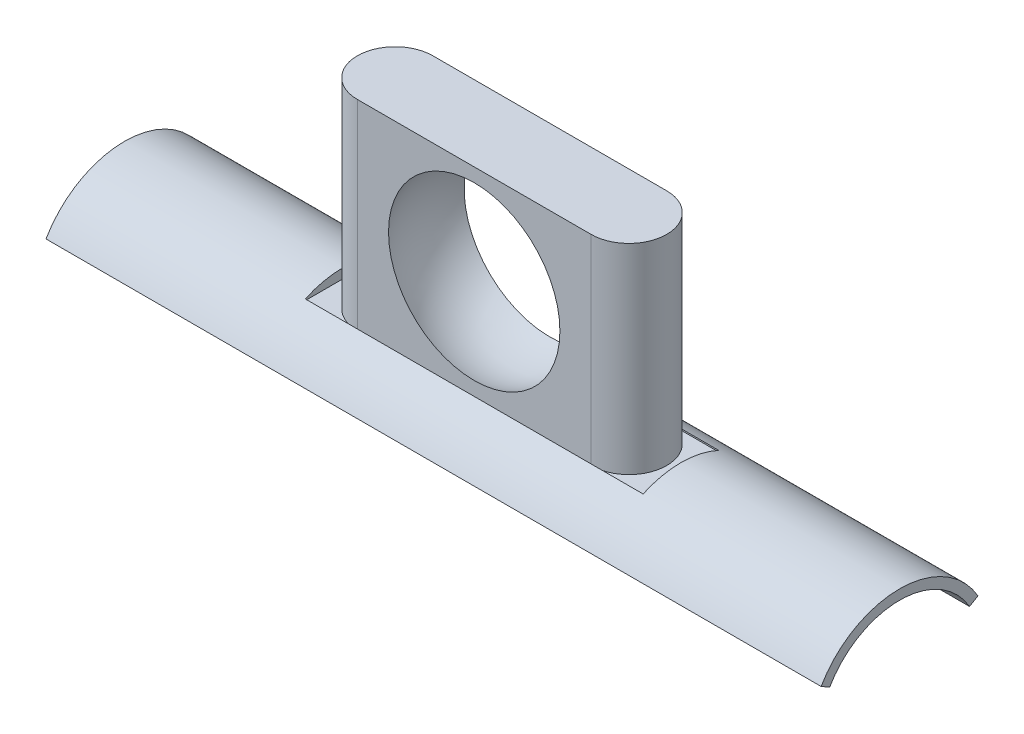
ISO-10303-21;
HEADER;
FILE_DESCRIPTION(('STEP AP214'),'2;1');
FILE_NAME('part.step','',(''),(''),'','','');
FILE_SCHEMA(('AUTOMOTIVE_DESIGN { 1 0 10303 214 1 1 1 1 }'));
ENDSEC;
DATA;
#1=APPLICATION_CONTEXT('core data for automotive mechanical design processes');
#2=APPLICATION_PROTOCOL_DEFINITION('international standard','automotive_design',2000,#1);
#3=PRODUCT_CONTEXT('',#1,'mechanical');
#4=PRODUCT('Part','Part','',(#3));
#5=PRODUCT_RELATED_PRODUCT_CATEGORY('part','',(#4));
#6=PRODUCT_DEFINITION_FORMATION('','',#4);
#7=PRODUCT_DEFINITION_CONTEXT('part definition',#1,'design');
#8=PRODUCT_DEFINITION('design','',#6,#7);
#9=PRODUCT_DEFINITION_SHAPE('','',#8);
#10=(LENGTH_UNIT() NAMED_UNIT(*) SI_UNIT(.MILLI.,.METRE.));
#11=(NAMED_UNIT(*) PLANE_ANGLE_UNIT() SI_UNIT($,.RADIAN.));
#12=(NAMED_UNIT(*) SI_UNIT($,.STERADIAN.) SOLID_ANGLE_UNIT());
#13=UNCERTAINTY_MEASURE_WITH_UNIT(LENGTH_MEASURE(1.E-05),#10,'distance_accuracy_value','');
#14=(GEOMETRIC_REPRESENTATION_CONTEXT(3) GLOBAL_UNCERTAINTY_ASSIGNED_CONTEXT((#13)) GLOBAL_UNIT_ASSIGNED_CONTEXT((#10,
#11,#12)) REPRESENTATION_CONTEXT('',''));
#15=CARTESIAN_POINT('',(0.,0.,0.));
#16=DIRECTION('',(0.,0.,1.));
#17=DIRECTION('',(1.,0.,0.));
#18=AXIS2_PLACEMENT_3D('',#15,#16,#17);
#19=CARTESIAN_POINT('',(-66.421,31.8135,-14.859));
#20=DIRECTION('',(0.,0.,-1.));
#21=DIRECTION('',(-1.,0.,0.));
#22=AXIS2_PLACEMENT_3D('',#19,#20,#21);
#23=PLANE('',#22);
#24=DIRECTION('',(0.,-1.,0.));
#25=VECTOR('',#24,1.);
#26=CARTESIAN_POINT('',(45.974,110.5535,-14.859));
#27=LINE('',#26,#25);
#28=CARTESIAN_POINT('',(45.974,32.3765944974143,-14.859));
#29=VERTEX_POINT('',#28);
#30=CARTESIAN_POINT('',(45.974,31.8135,-14.859));
#31=VERTEX_POINT('',#30);
#32=EDGE_CURVE('E256',#29,#31,#27,.T.);
#33=ORIENTED_EDGE('',*,*,#32,.T.);
#34=DIRECTION('',(-1.,0.,0.));
#35=VECTOR('',#34,1.);
#36=CARTESIAN_POINT('',(-66.421,31.8135,-14.859));
#37=LINE('',#36,#35);
#38=CARTESIAN_POINT('',(66.421,31.8135,-14.859));
#39=VERTEX_POINT('',#38);
#40=EDGE_CURVE('E182',#39,#31,#37,.T.);
#41=ORIENTED_EDGE('',*,*,#40,.F.);
#42=DIRECTION('',(0.,1.,0.));
#43=VECTOR('',#42,1.);
#44=CARTESIAN_POINT('',(66.421,31.8135,-14.859));
#45=LINE('',#44,#43);
#46=CARTESIAN_POINT('',(66.421,32.3765944974143,-14.859));
#47=VERTEX_POINT('',#46);
#48=EDGE_CURVE('E189',#39,#47,#45,.T.);
#49=ORIENTED_EDGE('',*,*,#48,.T.);
#50=DIRECTION('',(-1.,0.,0.));
#51=VECTOR('',#50,1.);
#52=CARTESIAN_POINT('',(152.4,32.3765944974143,-14.859));
#53=LINE('',#52,#51);
#54=EDGE_CURVE('E43',#29,#47,#53,.F.);
#55=ORIENTED_EDGE('',*,*,#54,.F.);
#56=EDGE_LOOP('',(#33,#41,#49,#55));
#57=FACE_BOUND('',#56,.T.);
#58=ADVANCED_FACE('F34',(#57),#23,.F.);
#59=CARTESIAN_POINT('',(-66.421,31.8135,14.859));
#60=DIRECTION('',(0.,0.,1.));
#61=DIRECTION('',(1.,0.,0.));
#62=AXIS2_PLACEMENT_3D('',#59,#60,#61);
#63=PLANE('',#62);
#64=DIRECTION('',(0.,-1.,0.));
#65=VECTOR('',#64,1.);
#66=CARTESIAN_POINT('',(-45.974,110.5535,14.859));
#67=LINE('',#66,#65);
#68=CARTESIAN_POINT('',(-45.974,32.3765944974143,14.859));
#69=VERTEX_POINT('',#68);
#70=CARTESIAN_POINT('',(-45.974,31.8135,14.859));
#71=VERTEX_POINT('',#70);
#72=EDGE_CURVE('E161',#69,#71,#67,.T.);
#73=ORIENTED_EDGE('',*,*,#72,.T.);
#74=DIRECTION('',(1.,0.,0.));
#75=VECTOR('',#74,1.);
#76=CARTESIAN_POINT('',(-66.421,31.8135,14.859));
#77=LINE('',#76,#75);
#78=CARTESIAN_POINT('',(-66.421,31.8135,14.859));
#79=VERTEX_POINT('',#78);
#80=EDGE_CURVE('E175',#79,#71,#77,.T.);
#81=ORIENTED_EDGE('',*,*,#80,.F.);
#82=DIRECTION('',(0.,1.,0.));
#83=VECTOR('',#82,1.);
#84=CARTESIAN_POINT('',(-66.421,31.8135,14.859));
#85=LINE('',#84,#83);
#86=CARTESIAN_POINT('',(-66.421,32.3765944974143,14.859));
#87=VERTEX_POINT('',#86);
#88=EDGE_CURVE('E184',#79,#87,#85,.T.);
#89=ORIENTED_EDGE('',*,*,#88,.T.);
#90=DIRECTION('',(-1.,0.,0.));
#91=VECTOR('',#90,1.);
#92=CARTESIAN_POINT('',(152.4,32.3765944974143,14.859));
#93=LINE('',#92,#91);
#94=EDGE_CURVE('E231',#69,#87,#93,.T.);
#95=ORIENTED_EDGE('',*,*,#94,.F.);
#96=EDGE_LOOP('',(#73,#81,#89,#95));
#97=FACE_BOUND('',#96,.T.);
#98=ADVANCED_FACE('F244',(#97),#63,.F.);
#99=CARTESIAN_POINT('',(0.,31.8135,0.));
#100=DIRECTION('',(0.,-1.,0.));
#101=DIRECTION('',(0.,0.,-1.));
#102=AXIS2_PLACEMENT_3D('',#99,#100,#101);
#103=PLANE('',#102);
#104=CARTESIAN_POINT('',(-45.974,31.8135,0.));
#105=DIRECTION('',(0.,1.,0.));
#106=DIRECTION('',(0.,0.,1.));
#107=AXIS2_PLACEMENT_3D('',#104,#105,#106);
#108=CIRCLE('',#107,14.859);
#109=CARTESIAN_POINT('',(-45.974,31.8135,-14.859));
#110=VERTEX_POINT('',#109);
#111=EDGE_CURVE('E247',#110,#71,#108,.T.);
#112=ORIENTED_EDGE('',*,*,#111,.F.);
#113=CARTESIAN_POINT('',(-66.421,31.8135,-14.859));
#114=VERTEX_POINT('',#113);
#115=EDGE_CURVE('E181',#110,#114,#37,.T.);
#116=ORIENTED_EDGE('',*,*,#115,.T.);
#117=DIRECTION('',(0.,0.,1.));
#118=VECTOR('',#117,1.);
#119=CARTESIAN_POINT('',(-66.421,31.8135,14.859));
#120=LINE('',#119,#118);
#121=EDGE_CURVE('E171',#114,#79,#120,.T.);
#122=ORIENTED_EDGE('',*,*,#121,.T.);
#123=ORIENTED_EDGE('',*,*,#80,.T.);
#124=EDGE_LOOP('',(#112,#116,#122,#123));
#125=FACE_BOUND('',#124,.T.);
#126=ADVANCED_FACE('F246',(#125),#103,.F.);
#127=CARTESIAN_POINT('',(45.974,31.8135,0.));
#128=DIRECTION('',(0.,1.,0.));
#129=DIRECTION('',(0.,0.,1.));
#130=AXIS2_PLACEMENT_3D('',#127,#128,#129);
#131=CIRCLE('',#130,14.859);
#132=CARTESIAN_POINT('',(45.974,31.8135,14.859));
#133=VERTEX_POINT('',#132);
#134=EDGE_CURVE('E156',#133,#31,#131,.T.);
#135=ORIENTED_EDGE('',*,*,#134,.F.);
#136=CARTESIAN_POINT('',(66.421,31.8135,14.859));
#137=VERTEX_POINT('',#136);
#138=EDGE_CURVE('E174',#133,#137,#77,.T.);
#139=ORIENTED_EDGE('',*,*,#138,.T.);
#140=DIRECTION('',(0.,0.,-1.));
#141=VECTOR('',#140,1.);
#142=CARTESIAN_POINT('',(66.421,31.8135,14.859));
#143=LINE('',#142,#141);
#144=EDGE_CURVE('E178',#137,#39,#143,.T.);
#145=ORIENTED_EDGE('',*,*,#144,.T.);
#146=ORIENTED_EDGE('',*,*,#40,.T.);
#147=EDGE_LOOP('',(#135,#139,#145,#146));
#148=FACE_BOUND('',#147,.T.);
#149=ADVANCED_FACE('F329',(#148),#103,.F.);
#150=CARTESIAN_POINT('',(152.4,0.,0.));
#151=DIRECTION('',(-1.,0.,0.));
#152=DIRECTION('',(0.,0.,1.));
#153=AXIS2_PLACEMENT_3D('',#150,#151,#152);
#154=CYLINDRICAL_SURFACE('',#153,35.6235);
#155=CARTESIAN_POINT('',(-66.421,32.3765944974143,-14.859));
#156=VERTEX_POINT('',#155);
#157=CARTESIAN_POINT('',(-45.974,32.3765944974143,-14.859));
#158=VERTEX_POINT('',#157);
#159=EDGE_CURVE('E11',#156,#158,#53,.F.);
#160=ORIENTED_EDGE('',*,*,#159,.T.);
#161=DIRECTION('',(-1.,0.,0.));
#162=VECTOR('',#161,1.);
#163=CARTESIAN_POINT('',(152.4,32.3765944974143,-14.859));
#164=LINE('',#163,#162);
#165=EDGE_CURVE('E162',#29,#158,#164,.T.);
#166=ORIENTED_EDGE('',*,*,#165,.F.);
#167=ORIENTED_EDGE('',*,*,#54,.T.);
#168=CARTESIAN_POINT('',(66.421,0.,0.));
#169=DIRECTION('',(1.,0.,0.));
#170=DIRECTION('',(0.,0.,-1.));
#171=AXIS2_PLACEMENT_3D('',#168,#169,#170);
#172=CIRCLE('',#171,35.6235);
#173=CARTESIAN_POINT('',(66.421,32.3765944974143,14.859));
#174=VERTEX_POINT('',#173);
#175=EDGE_CURVE('E225',#47,#174,#172,.T.);
#176=ORIENTED_EDGE('',*,*,#175,.T.);
#177=CARTESIAN_POINT('',(45.974,32.3765944974143,14.859));
#178=VERTEX_POINT('',#177);
#179=EDGE_CURVE('E232',#174,#178,#93,.T.);
#180=ORIENTED_EDGE('',*,*,#179,.T.);
#181=DIRECTION('',(-1.,0.,0.));
#182=VECTOR('',#181,1.);
#183=CARTESIAN_POINT('',(152.4,32.3765944974143,14.859));
#184=LINE('',#183,#182);
#185=EDGE_CURVE('E165',#69,#178,#184,.F.);
#186=ORIENTED_EDGE('',*,*,#185,.F.);
#187=ORIENTED_EDGE('',*,*,#94,.T.);
#188=CARTESIAN_POINT('',(-66.421,0.,0.));
#189=DIRECTION('',(-1.,0.,0.));
#190=DIRECTION('',(0.,0.,1.));
#191=AXIS2_PLACEMENT_3D('',#188,#189,#190);
#192=CIRCLE('',#191,35.6235);
#193=EDGE_CURVE('E228',#87,#156,#192,.T.);
#194=ORIENTED_EDGE('',*,*,#193,.T.);
#195=EDGE_LOOP('',(#160,#166,#167,#176,#180,#186,#187,#194));
#196=FACE_BOUND('',#195,.T.);
#197=CARTESIAN_POINT('',(-152.4,0.,0.));
#198=DIRECTION('',(1.,0.,0.));
#199=DIRECTION('',(0.,0.,-1.));
#200=AXIS2_PLACEMENT_3D('',#197,#198,#199);
#201=CIRCLE('',#200,35.6235);
#202=CARTESIAN_POINT('',(-152.4,17.8117499999999,-30.850855971715));
#203=VERTEX_POINT('',#202);
#204=CARTESIAN_POINT('',(-152.4,17.8117499999999,30.850855971715));
#205=VERTEX_POINT('',#204);
#206=EDGE_CURVE('E188',#203,#205,#201,.T.);
#207=ORIENTED_EDGE('',*,*,#206,.T.);
#208=DIRECTION('',(-1.,0.,0.));
#209=VECTOR('',#208,1.);
#210=CARTESIAN_POINT('',(152.4,17.8117499999999,30.850855971715));
#211=LINE('',#210,#209);
#212=CARTESIAN_POINT('',(152.4,17.8117499999999,30.850855971715));
#213=VERTEX_POINT('',#212);
#214=EDGE_CURVE('E222',#213,#205,#211,.T.);
#215=ORIENTED_EDGE('',*,*,#214,.F.);
#216=CARTESIAN_POINT('',(152.4,0.,0.));
#217=DIRECTION('',(1.,0.,0.));
#218=DIRECTION('',(0.,0.,-1.));
#219=AXIS2_PLACEMENT_3D('',#216,#217,#218);
#220=CIRCLE('',#219,35.6235);
#221=CARTESIAN_POINT('',(152.4,17.8117499999999,-30.850855971715));
#222=VERTEX_POINT('',#221);
#223=EDGE_CURVE('E196',#222,#213,#220,.T.);
#224=ORIENTED_EDGE('',*,*,#223,.F.);
#225=DIRECTION('',(-1.,0.,0.));
#226=VECTOR('',#225,1.);
#227=CARTESIAN_POINT('',(152.4,17.8117499999999,-30.850855971715));
#228=LINE('',#227,#226);
#229=EDGE_CURVE('E206',#222,#203,#228,.T.);
#230=ORIENTED_EDGE('',*,*,#229,.T.);
#231=EDGE_LOOP('',(#207,#215,#224,#230));
#232=FACE_BOUND('',#231,.T.);
#233=ADVANCED_FACE('F36',(#196,#232),#154,.T.);
#234=CARTESIAN_POINT('',(152.4,15.8749999999999,27.496306570156));
#235=DIRECTION('',(0.,0.86602540378444,-0.499999999999997));
#236=DIRECTION('',(0.,0.499999999999997,0.86602540378444));
#237=AXIS2_PLACEMENT_3D('',#234,#235,#236);
#238=PLANE('',#237);
#239=DIRECTION('',(0.,-0.499999999999997,-0.86602540378444));
#240=VECTOR('',#239,1.);
#241=CARTESIAN_POINT('',(-152.4,15.8749999999999,27.496306570156));
#242=LINE('',#241,#240);
#243=CARTESIAN_POINT('',(-152.4,15.8749999999999,27.496306570156));
#244=VERTEX_POINT('',#243);
#245=EDGE_CURVE('E209',#205,#244,#242,.T.);
#246=ORIENTED_EDGE('',*,*,#245,.T.);
#247=DIRECTION('',(-1.,0.,0.));
#248=VECTOR('',#247,1.);
#249=CARTESIAN_POINT('',(152.4,15.8749999999999,27.496306570156));
#250=LINE('',#249,#248);
#251=CARTESIAN_POINT('',(152.4,15.8749999999999,27.496306570156));
#252=VERTEX_POINT('',#251);
#253=EDGE_CURVE('E219',#252,#244,#250,.T.);
#254=ORIENTED_EDGE('',*,*,#253,.F.);
#255=DIRECTION('',(0.,-0.499999999999997,-0.86602540378444));
#256=VECTOR('',#255,1.);
#257=CARTESIAN_POINT('',(152.4,15.8749999999999,27.496306570156));
#258=LINE('',#257,#256);
#259=EDGE_CURVE('E199',#213,#252,#258,.T.);
#260=ORIENTED_EDGE('',*,*,#259,.F.);
#261=ORIENTED_EDGE('',*,*,#214,.T.);
#262=EDGE_LOOP('',(#246,#254,#260,#261));
#263=FACE_BOUND('',#262,.T.);
#264=ADVANCED_FACE('F322',(#263),#238,.F.);
#265=CARTESIAN_POINT('',(152.4,0.,0.));
#266=DIRECTION('',(-1.,0.,0.));
#267=DIRECTION('',(0.,0.,1.));
#268=AXIS2_PLACEMENT_3D('',#265,#266,#267);
#269=CYLINDRICAL_SURFACE('',#268,31.75);
#270=CARTESIAN_POINT('',(-152.4,0.,0.));
#271=DIRECTION('',(-1.,0.,0.));
#272=DIRECTION('',(0.,0.,-1.));
#273=AXIS2_PLACEMENT_3D('',#270,#271,#272);
#274=CIRCLE('',#273,31.75);
#275=CARTESIAN_POINT('',(-152.4,15.8749999999999,-27.496306570156));
#276=VERTEX_POINT('',#275);
#277=EDGE_CURVE('E211',#244,#276,#274,.T.);
#278=ORIENTED_EDGE('',*,*,#277,.T.);
#279=DIRECTION('',(-1.,0.,0.));
#280=VECTOR('',#279,1.);
#281=CARTESIAN_POINT('',(152.4,15.8749999999999,-27.496306570156));
#282=LINE('',#281,#280);
#283=CARTESIAN_POINT('',(152.4,15.8749999999999,-27.496306570156));
#284=VERTEX_POINT('',#283);
#285=EDGE_CURVE('E216',#284,#276,#282,.T.);
#286=ORIENTED_EDGE('',*,*,#285,.F.);
#287=CARTESIAN_POINT('',(152.4,0.,0.));
#288=DIRECTION('',(-1.,0.,0.));
#289=DIRECTION('',(0.,0.,-1.));
#290=AXIS2_PLACEMENT_3D('',#287,#288,#289);
#291=CIRCLE('',#290,31.75);
#292=EDGE_CURVE('E202',#252,#284,#291,.T.);
#293=ORIENTED_EDGE('',*,*,#292,.F.);
#294=ORIENTED_EDGE('',*,*,#253,.T.);
#295=EDGE_LOOP('',(#278,#286,#293,#294));
#296=FACE_BOUND('',#295,.T.);
#297=ADVANCED_FACE('F319',(#296),#269,.F.);
#298=CARTESIAN_POINT('',(152.4,15.8749999999999,-27.496306570156));
#299=DIRECTION('',(0.,0.866025403784441,0.499999999999996));
#300=DIRECTION('',(0.,-0.499999999999996,0.866025403784441));
#301=AXIS2_PLACEMENT_3D('',#298,#299,#300);
#302=PLANE('',#301);
#303=DIRECTION('',(0.,0.499999999999996,-0.866025403784441));
#304=VECTOR('',#303,1.);
#305=CARTESIAN_POINT('',(-152.4,15.8749999999999,-27.496306570156));
#306=LINE('',#305,#304);
#307=EDGE_CURVE('E200',#276,#203,#306,.T.);
#308=ORIENTED_EDGE('',*,*,#307,.T.);
#309=ORIENTED_EDGE('',*,*,#229,.F.);
#310=DIRECTION('',(0.,0.499999999999996,-0.866025403784441));
#311=VECTOR('',#310,1.);
#312=CARTESIAN_POINT('',(152.4,15.8749999999999,-27.496306570156));
#313=LINE('',#312,#311);
#314=EDGE_CURVE('E204',#284,#222,#313,.T.);
#315=ORIENTED_EDGE('',*,*,#314,.F.);
#316=ORIENTED_EDGE('',*,*,#285,.T.);
#317=EDGE_LOOP('',(#308,#309,#315,#316));
#318=FACE_BOUND('',#317,.T.);
#319=ADVANCED_FACE('F314',(#318),#302,.F.);
#320=CARTESIAN_POINT('',(152.4,0.,0.));
#321=DIRECTION('',(1.,0.,0.));
#322=DIRECTION('',(0.,0.,-1.));
#323=AXIS2_PLACEMENT_3D('',#320,#321,#322);
#324=PLANE('',#323);
#325=ORIENTED_EDGE('',*,*,#223,.T.);
#326=ORIENTED_EDGE('',*,*,#259,.T.);
#327=ORIENTED_EDGE('',*,*,#292,.T.);
#328=ORIENTED_EDGE('',*,*,#314,.T.);
#329=EDGE_LOOP('',(#325,#326,#327,#328));
#330=FACE_BOUND('',#329,.T.);
#331=ADVANCED_FACE('F309',(#330),#324,.T.);
#332=CARTESIAN_POINT('',(-152.4,0.,0.));
#333=DIRECTION('',(1.,0.,0.));
#334=DIRECTION('',(0.,0.,-1.));
#335=AXIS2_PLACEMENT_3D('',#332,#333,#334);
#336=PLANE('',#335);
#337=ORIENTED_EDGE('',*,*,#206,.F.);
#338=ORIENTED_EDGE('',*,*,#307,.F.);
#339=ORIENTED_EDGE('',*,*,#277,.F.);
#340=ORIENTED_EDGE('',*,*,#245,.F.);
#341=EDGE_LOOP('',(#337,#338,#339,#340));
#342=FACE_BOUND('',#341,.T.);
#343=ADVANCED_FACE('F304',(#342),#336,.F.);
#344=CARTESIAN_POINT('',(-66.421,31.8135,14.859));
#345=DIRECTION('',(-1.,0.,0.));
#346=DIRECTION('',(0.,0.,1.));
#347=AXIS2_PLACEMENT_3D('',#344,#345,#346);
#348=PLANE('',#347);
#349=ORIENTED_EDGE('',*,*,#88,.F.);
#350=ORIENTED_EDGE('',*,*,#121,.F.);
#351=DIRECTION('',(0.,1.,0.));
#352=VECTOR('',#351,1.);
#353=CARTESIAN_POINT('',(-66.421,31.8135,-14.859));
#354=LINE('',#353,#352);
#355=EDGE_CURVE('E185',#114,#156,#354,.T.);
#356=ORIENTED_EDGE('',*,*,#355,.T.);
#357=ORIENTED_EDGE('',*,*,#193,.F.);
#358=EDGE_LOOP('',(#349,#350,#356,#357));
#359=FACE_BOUND('',#358,.T.);
#360=ADVANCED_FACE('F240',(#359),#348,.F.);
#361=ORIENTED_EDGE('',*,*,#115,.F.);
#362=DIRECTION('',(0.,-1.,0.));
#363=VECTOR('',#362,1.);
#364=CARTESIAN_POINT('',(-45.974,110.5535,-14.859));
#365=LINE('',#364,#363);
#366=EDGE_CURVE('E57',#158,#110,#365,.T.);
#367=ORIENTED_EDGE('',*,*,#366,.F.);
#368=ORIENTED_EDGE('',*,*,#159,.F.);
#369=ORIENTED_EDGE('',*,*,#355,.F.);
#370=EDGE_LOOP('',(#361,#367,#368,#369));
#371=FACE_BOUND('',#370,.T.);
#372=ADVANCED_FACE('F248',(#371),#23,.F.);
#373=CARTESIAN_POINT('',(66.421,31.8135,14.859));
#374=DIRECTION('',(1.,0.,0.));
#375=DIRECTION('',(0.,0.,-1.));
#376=AXIS2_PLACEMENT_3D('',#373,#374,#375);
#377=PLANE('',#376);
#378=ORIENTED_EDGE('',*,*,#48,.F.);
#379=ORIENTED_EDGE('',*,*,#144,.F.);
#380=DIRECTION('',(0.,1.,0.));
#381=VECTOR('',#380,1.);
#382=CARTESIAN_POINT('',(66.421,31.8135,14.859));
#383=LINE('',#382,#381);
#384=EDGE_CURVE('E191',#137,#174,#383,.T.);
#385=ORIENTED_EDGE('',*,*,#384,.T.);
#386=ORIENTED_EDGE('',*,*,#175,.F.);
#387=EDGE_LOOP('',(#378,#379,#385,#386));
#388=FACE_BOUND('',#387,.T.);
#389=ADVANCED_FACE('F298',(#388),#377,.F.);
#390=ORIENTED_EDGE('',*,*,#138,.F.);
#391=DIRECTION('',(0.,-1.,0.));
#392=VECTOR('',#391,1.);
#393=CARTESIAN_POINT('',(45.974,110.5535,14.859));
#394=LINE('',#393,#392);
#395=EDGE_CURVE('E260',#178,#133,#394,.T.);
#396=ORIENTED_EDGE('',*,*,#395,.F.);
#397=ORIENTED_EDGE('',*,*,#179,.F.);
#398=ORIENTED_EDGE('',*,*,#384,.F.);
#399=EDGE_LOOP('',(#390,#396,#397,#398));
#400=FACE_BOUND('',#399,.T.);
#401=ADVANCED_FACE('F284',(#400),#63,.F.);
#402=CARTESIAN_POINT('',(-45.974,110.5535,14.859));
#403=DIRECTION('',(0.,0.,-1.));
#404=DIRECTION('',(-1.,0.,0.));
#405=AXIS2_PLACEMENT_3D('',#402,#403,#404);
#406=PLANE('',#405);
#407=CARTESIAN_POINT('',(0.,71.4925944974143,14.859));
#408=DIRECTION('',(0.,0.,-1.));
#409=DIRECTION('',(-1.,0.,0.));
#410=AXIS2_PLACEMENT_3D('',#407,#408,#409);
#411=CIRCLE('',#410,33.6995403381114);
#412=CARTESIAN_POINT('',(-33.6995403381114,71.4925944974143,14.859));
#413=VERTEX_POINT('',#412);
#414=EDGE_CURVE('E267',#413,#413,#411,.F.);
#415=ORIENTED_EDGE('',*,*,#414,.F.);
#416=EDGE_LOOP('',(#415));
#417=FACE_BOUND('',#416,.T.);
#418=CARTESIAN_POINT('',(-45.974,110.5535,14.859));
#419=VERTEX_POINT('',#418);
#420=EDGE_CURVE('E141',#419,#69,#67,.T.);
#421=ORIENTED_EDGE('',*,*,#420,.T.);
#422=ORIENTED_EDGE('',*,*,#185,.T.);
#423=CARTESIAN_POINT('',(45.974,110.5535,14.859));
#424=VERTEX_POINT('',#423);
#425=EDGE_CURVE('E143',#424,#178,#394,.T.);
#426=ORIENTED_EDGE('',*,*,#425,.F.);
#427=DIRECTION('',(1.,0.,0.));
#428=VECTOR('',#427,1.);
#429=CARTESIAN_POINT('',(-45.974,110.5535,14.859));
#430=LINE('',#429,#428);
#431=EDGE_CURVE('E136',#419,#424,#430,.T.);
#432=ORIENTED_EDGE('',*,*,#431,.F.);
#433=EDGE_LOOP('',(#421,#422,#426,#432));
#434=FACE_BOUND('',#433,.T.);
#435=ADVANCED_FACE('F138',(#417,#434),#406,.F.);
#436=CARTESIAN_POINT('',(-45.974,110.5535,-14.859));
#437=DIRECTION('',(0.,0.,1.));
#438=DIRECTION('',(1.,0.,0.));
#439=AXIS2_PLACEMENT_3D('',#436,#437,#438);
#440=PLANE('',#439);
#441=CARTESIAN_POINT('',(0.,71.4925944974143,-14.859));
#442=DIRECTION('',(0.,0.,1.));
#443=DIRECTION('',(1.,0.,0.));
#444=AXIS2_PLACEMENT_3D('',#441,#442,#443);
#445=CIRCLE('',#444,33.6995403381114);
#446=CARTESIAN_POINT('',(33.6995403381114,71.4925944974143,-14.859));
#447=VERTEX_POINT('',#446);
#448=EDGE_CURVE('E38',#447,#447,#445,.F.);
#449=ORIENTED_EDGE('',*,*,#448,.F.);
#450=EDGE_LOOP('',(#449));
#451=FACE_BOUND('',#450,.T.);
#452=CARTESIAN_POINT('',(45.974,110.5535,-14.859));
#453=VERTEX_POINT('',#452);
#454=EDGE_CURVE('E255',#453,#29,#27,.T.);
#455=ORIENTED_EDGE('',*,*,#454,.T.);
#456=ORIENTED_EDGE('',*,*,#165,.T.);
#457=CARTESIAN_POINT('',(-45.974,110.5535,-14.859));
#458=VERTEX_POINT('',#457);
#459=EDGE_CURVE('E253',#458,#158,#365,.T.);
#460=ORIENTED_EDGE('',*,*,#459,.F.);
#461=DIRECTION('',(-1.,0.,0.));
#462=VECTOR('',#461,1.);
#463=CARTESIAN_POINT('',(-45.974,110.5535,-14.859));
#464=LINE('',#463,#462);
#465=EDGE_CURVE('E152',#453,#458,#464,.T.);
#466=ORIENTED_EDGE('',*,*,#465,.F.);
#467=EDGE_LOOP('',(#455,#456,#460,#466));
#468=FACE_BOUND('',#467,.T.);
#469=ADVANCED_FACE('F252',(#451,#468),#440,.F.);
#470=CARTESIAN_POINT('',(-45.974,110.5535,0.));
#471=DIRECTION('',(0.,-1.,0.));
#472=DIRECTION('',(0.,0.,-1.));
#473=AXIS2_PLACEMENT_3D('',#470,#471,#472);
#474=CYLINDRICAL_SURFACE('',#473,14.859);
#475=ORIENTED_EDGE('',*,*,#111,.T.);
#476=ORIENTED_EDGE('',*,*,#72,.F.);
#477=ORIENTED_EDGE('',*,*,#420,.F.);
#478=CARTESIAN_POINT('',(-45.974,110.5535,0.));
#479=DIRECTION('',(0.,1.,0.));
#480=DIRECTION('',(0.,0.,1.));
#481=AXIS2_PLACEMENT_3D('',#478,#479,#480);
#482=CIRCLE('',#481,14.859);
#483=EDGE_CURVE('E147',#458,#419,#482,.T.);
#484=ORIENTED_EDGE('',*,*,#483,.F.);
#485=ORIENTED_EDGE('',*,*,#459,.T.);
#486=ORIENTED_EDGE('',*,*,#366,.T.);
#487=EDGE_LOOP('',(#475,#476,#477,#484,#485,#486));
#488=FACE_BOUND('',#487,.T.);
#489=ADVANCED_FACE('F160',(#488),#474,.T.);
#490=CARTESIAN_POINT('',(45.974,110.5535,0.));
#491=DIRECTION('',(0.,-1.,0.));
#492=DIRECTION('',(0.,0.,-1.));
#493=AXIS2_PLACEMENT_3D('',#490,#491,#492);
#494=CYLINDRICAL_SURFACE('',#493,14.859);
#495=ORIENTED_EDGE('',*,*,#134,.T.);
#496=ORIENTED_EDGE('',*,*,#32,.F.);
#497=ORIENTED_EDGE('',*,*,#454,.F.);
#498=CARTESIAN_POINT('',(45.974,110.5535,0.));
#499=DIRECTION('',(0.,1.,0.));
#500=DIRECTION('',(0.,0.,1.));
#501=AXIS2_PLACEMENT_3D('',#498,#499,#500);
#502=CIRCLE('',#501,14.859);
#503=EDGE_CURVE('E146',#424,#453,#502,.T.);
#504=ORIENTED_EDGE('',*,*,#503,.F.);
#505=ORIENTED_EDGE('',*,*,#425,.T.);
#506=ORIENTED_EDGE('',*,*,#395,.T.);
#507=EDGE_LOOP('',(#495,#496,#497,#504,#505,#506));
#508=FACE_BOUND('',#507,.T.);
#509=ADVANCED_FACE('F264',(#508),#494,.T.);
#510=CARTESIAN_POINT('',(-45.974,110.5535,0.));
#511=DIRECTION('',(0.,1.,0.));
#512=DIRECTION('',(0.,0.,1.));
#513=AXIS2_PLACEMENT_3D('',#510,#511,#512);
#514=PLANE('',#513);
#515=ORIENTED_EDGE('',*,*,#483,.T.);
#516=ORIENTED_EDGE('',*,*,#431,.T.);
#517=ORIENTED_EDGE('',*,*,#503,.T.);
#518=ORIENTED_EDGE('',*,*,#465,.T.);
#519=EDGE_LOOP('',(#515,#516,#517,#518));
#520=FACE_BOUND('',#519,.T.);
#521=ADVANCED_FACE('F150',(#520),#514,.T.);
#522=CARTESIAN_POINT('',(0.,71.4925944974143,0.));
#523=DIRECTION('',(0.,1.,0.));
#524=DIRECTION('',(1.,0.,0.));
#525=AXIS2_PLACEMENT_3D('',#522,#523,#524);
#526=SPHERICAL_SURFACE('',#525,36.83);
#527=CARTESIAN_POINT('',(0.,71.4925944974143,0.));
#528=DIRECTION('',(0.,0.,1.));
#529=DIRECTION('',(1.,0.,0.));
#530=AXIS2_PLACEMENT_3D('',#527,#528,#529);
#531=SPHERICAL_SURFACE('',#530,36.83);
#532=ORIENTED_EDGE('',*,*,#448,.T.);
#533=EDGE_LOOP('',(#532));
#534=FACE_BOUND('',#533,.T.);
#535=ORIENTED_EDGE('',*,*,#414,.T.);
#536=EDGE_LOOP('',(#535));
#537=FACE_BOUND('',#536,.T.);
#538=ADVANCED_FACE('F275',(#534,#537),#531,.F.);
#539=CLOSED_SHELL('',(#58,#98,#126,#149,#233,#264,#297,#319,#331,#343,#360,#372,#389,#401,#435,
#469,#489,#509,#521,#538));
#540=MANIFOLD_SOLID_BREP('B2',#539);
#541=ADVANCED_BREP_SHAPE_REPRESENTATION('',(#18,#540),#14);
#542=SHAPE_DEFINITION_REPRESENTATION(#9,#541);
ENDSEC;
END-ISO-10303-21;
